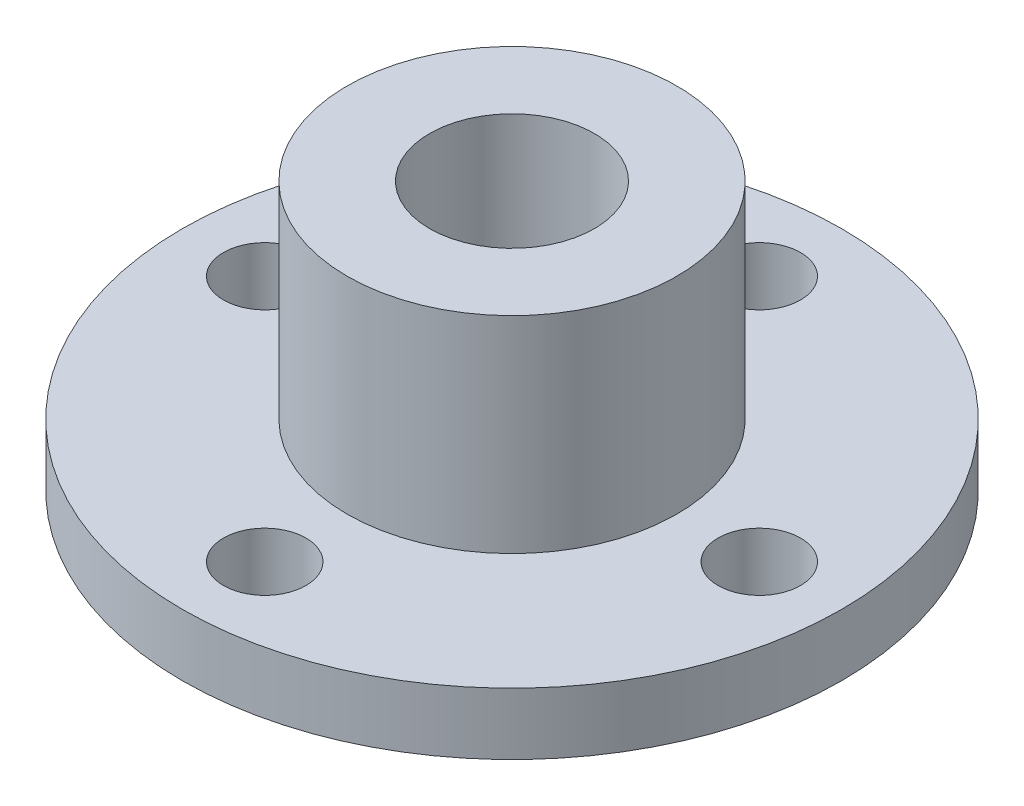
ISO-10303-21;
HEADER;
FILE_DESCRIPTION(('STEP AP214'),'2;1');
FILE_NAME('part.step','',(''),(''),'','','');
FILE_SCHEMA(('AUTOMOTIVE_DESIGN { 1 0 10303 214 1 1 1 1 }'));
ENDSEC;
DATA;
#1=APPLICATION_CONTEXT('core data for automotive mechanical design processes');
#2=APPLICATION_PROTOCOL_DEFINITION('international standard','automotive_design',2000,#1);
#3=PRODUCT_CONTEXT('',#1,'mechanical');
#4=PRODUCT('Part','Part','',(#3));
#5=PRODUCT_RELATED_PRODUCT_CATEGORY('part','',(#4));
#6=PRODUCT_DEFINITION_FORMATION('','',#4);
#7=PRODUCT_DEFINITION_CONTEXT('part definition',#1,'design');
#8=PRODUCT_DEFINITION('design','',#6,#7);
#9=PRODUCT_DEFINITION_SHAPE('','',#8);
#10=(LENGTH_UNIT() NAMED_UNIT(*) SI_UNIT(.MILLI.,.METRE.));
#11=(NAMED_UNIT(*) PLANE_ANGLE_UNIT() SI_UNIT($,.RADIAN.));
#12=(NAMED_UNIT(*) SI_UNIT($,.STERADIAN.) SOLID_ANGLE_UNIT());
#13=UNCERTAINTY_MEASURE_WITH_UNIT(LENGTH_MEASURE(1.E-05),#10,'distance_accuracy_value','');
#14=(GEOMETRIC_REPRESENTATION_CONTEXT(3) GLOBAL_UNCERTAINTY_ASSIGNED_CONTEXT((#13)) GLOBAL_UNIT_ASSIGNED_CONTEXT((#10,
#11,#12)) REPRESENTATION_CONTEXT('',''));
#15=CARTESIAN_POINT('',(0.,0.,0.));
#16=DIRECTION('',(0.,0.,1.));
#17=DIRECTION('',(1.,0.,0.));
#18=AXIS2_PLACEMENT_3D('',#15,#16,#17);
#19=CARTESIAN_POINT('',(0.,3.,-12.));
#20=DIRECTION('',(0.,-1.,0.));
#21=DIRECTION('',(0.,0.,-1.));
#22=AXIS2_PLACEMENT_3D('',#19,#20,#21);
#23=CYLINDRICAL_SURFACE('',#22,2.);
#24=CARTESIAN_POINT('',(0.,3.,-12.));
#25=DIRECTION('',(0.,1.,0.));
#26=DIRECTION('',(0.,0.,1.));
#27=AXIS2_PLACEMENT_3D('',#24,#25,#26);
#28=CIRCLE('',#27,2.);
#29=CARTESIAN_POINT('',(0.,3.,-10.));
#30=VERTEX_POINT('',#29);
#31=EDGE_CURVE('E43',#30,#30,#28,.T.);
#32=ORIENTED_EDGE('',*,*,#31,.T.);
#33=EDGE_LOOP('',(#32));
#34=FACE_BOUND('',#33,.T.);
#35=CARTESIAN_POINT('',(0.,0.,-12.));
#36=DIRECTION('',(0.,1.,0.));
#37=DIRECTION('',(0.,0.,1.));
#38=AXIS2_PLACEMENT_3D('',#35,#36,#37);
#39=CIRCLE('',#38,2.);
#40=CARTESIAN_POINT('',(0.,0.,-10.));
#41=VERTEX_POINT('',#40);
#42=EDGE_CURVE('E50',#41,#41,#39,.T.);
#43=ORIENTED_EDGE('',*,*,#42,.F.);
#44=EDGE_LOOP('',(#43));
#45=FACE_BOUND('',#44,.T.);
#46=ADVANCED_FACE('F31',(#34,#45),#23,.F.);
#47=CARTESIAN_POINT('',(12.,3.,0.));
#48=DIRECTION('',(0.,-1.,0.));
#49=DIRECTION('',(0.,0.,-1.));
#50=AXIS2_PLACEMENT_3D('',#47,#48,#49);
#51=CYLINDRICAL_SURFACE('',#50,2.);
#52=CARTESIAN_POINT('',(12.,3.,0.));
#53=DIRECTION('',(0.,1.,0.));
#54=DIRECTION('',(0.,0.,1.));
#55=AXIS2_PLACEMENT_3D('',#52,#53,#54);
#56=CIRCLE('',#55,2.);
#57=CARTESIAN_POINT('',(12.,3.,2.));
#58=VERTEX_POINT('',#57);
#59=EDGE_CURVE('E62',#58,#58,#56,.T.);
#60=ORIENTED_EDGE('',*,*,#59,.T.);
#61=EDGE_LOOP('',(#60));
#62=FACE_BOUND('',#61,.T.);
#63=CARTESIAN_POINT('',(12.,0.,0.));
#64=DIRECTION('',(0.,1.,0.));
#65=DIRECTION('',(0.,0.,1.));
#66=AXIS2_PLACEMENT_3D('',#63,#64,#65);
#67=CIRCLE('',#66,2.);
#68=CARTESIAN_POINT('',(12.,0.,2.));
#69=VERTEX_POINT('',#68);
#70=EDGE_CURVE('E53',#69,#69,#67,.T.);
#71=ORIENTED_EDGE('',*,*,#70,.F.);
#72=EDGE_LOOP('',(#71));
#73=FACE_BOUND('',#72,.T.);
#74=ADVANCED_FACE('F98',(#62,#73),#51,.F.);
#75=CARTESIAN_POINT('',(0.,3.,0.));
#76=DIRECTION('',(0.,-1.,0.));
#77=DIRECTION('',(0.,0.,-1.));
#78=AXIS2_PLACEMENT_3D('',#75,#76,#77);
#79=CYLINDRICAL_SURFACE('',#78,16.);
#80=CARTESIAN_POINT('',(0.,3.,0.));
#81=DIRECTION('',(0.,1.,0.));
#82=DIRECTION('',(0.,0.,1.));
#83=AXIS2_PLACEMENT_3D('',#80,#81,#82);
#84=CIRCLE('',#83,16.);
#85=CARTESIAN_POINT('',(0.,3.,16.));
#86=VERTEX_POINT('',#85);
#87=EDGE_CURVE('E49',#86,#86,#84,.T.);
#88=ORIENTED_EDGE('',*,*,#87,.F.);
#89=EDGE_LOOP('',(#88));
#90=FACE_BOUND('',#89,.T.);
#91=CARTESIAN_POINT('',(0.,0.,0.));
#92=DIRECTION('',(0.,1.,0.));
#93=DIRECTION('',(0.,0.,1.));
#94=AXIS2_PLACEMENT_3D('',#91,#92,#93);
#95=CIRCLE('',#94,16.);
#96=CARTESIAN_POINT('',(0.,0.,16.));
#97=VERTEX_POINT('',#96);
#98=EDGE_CURVE('E56',#97,#97,#95,.T.);
#99=ORIENTED_EDGE('',*,*,#98,.T.);
#100=EDGE_LOOP('',(#99));
#101=FACE_BOUND('',#100,.T.);
#102=ADVANCED_FACE('F33',(#90,#101),#79,.T.);
#103=CARTESIAN_POINT('',(-12.,3.,0.));
#104=DIRECTION('',(0.,-1.,0.));
#105=DIRECTION('',(0.,0.,-1.));
#106=AXIS2_PLACEMENT_3D('',#103,#104,#105);
#107=CYLINDRICAL_SURFACE('',#106,2.);
#108=CARTESIAN_POINT('',(-12.,3.,0.));
#109=DIRECTION('',(0.,1.,0.));
#110=DIRECTION('',(0.,0.,1.));
#111=AXIS2_PLACEMENT_3D('',#108,#109,#110);
#112=CIRCLE('',#111,2.);
#113=CARTESIAN_POINT('',(-12.,3.,2.));
#114=VERTEX_POINT('',#113);
#115=EDGE_CURVE('E39',#114,#114,#112,.T.);
#116=ORIENTED_EDGE('',*,*,#115,.T.);
#117=EDGE_LOOP('',(#116));
#118=FACE_BOUND('',#117,.T.);
#119=CARTESIAN_POINT('',(-12.,0.,0.));
#120=DIRECTION('',(0.,1.,0.));
#121=DIRECTION('',(0.,0.,1.));
#122=AXIS2_PLACEMENT_3D('',#119,#120,#121);
#123=CIRCLE('',#122,2.);
#124=CARTESIAN_POINT('',(-12.,0.,2.));
#125=VERTEX_POINT('',#124);
#126=EDGE_CURVE('E46',#125,#125,#123,.T.);
#127=ORIENTED_EDGE('',*,*,#126,.F.);
#128=EDGE_LOOP('',(#127));
#129=FACE_BOUND('',#128,.T.);
#130=ADVANCED_FACE('F107',(#118,#129),#107,.F.);
#131=CARTESIAN_POINT('',(0.,3.,0.));
#132=DIRECTION('',(0.,1.,0.));
#133=DIRECTION('',(0.,0.,1.));
#134=AXIS2_PLACEMENT_3D('',#131,#132,#133);
#135=PLANE('',#134);
#136=CARTESIAN_POINT('',(0.,3.,12.));
#137=DIRECTION('',(0.,1.,0.));
#138=DIRECTION('',(0.,0.,1.));
#139=AXIS2_PLACEMENT_3D('',#136,#137,#138);
#140=CIRCLE('',#139,2.);
#141=CARTESIAN_POINT('',(0.,3.,14.));
#142=VERTEX_POINT('',#141);
#143=EDGE_CURVE('E75',#142,#142,#140,.T.);
#144=ORIENTED_EDGE('',*,*,#143,.F.);
#145=EDGE_LOOP('',(#144));
#146=FACE_BOUND('',#145,.T.);
#147=CARTESIAN_POINT('',(0.,3.,0.));
#148=DIRECTION('',(0.,1.,0.));
#149=DIRECTION('',(0.,0.,1.));
#150=AXIS2_PLACEMENT_3D('',#147,#148,#149);
#151=CIRCLE('',#150,8.);
#152=CARTESIAN_POINT('',(0.,3.,8.));
#153=VERTEX_POINT('',#152);
#154=EDGE_CURVE('E67',#153,#153,#151,.T.);
#155=ORIENTED_EDGE('',*,*,#154,.F.);
#156=EDGE_LOOP('',(#155));
#157=FACE_BOUND('',#156,.T.);
#158=ORIENTED_EDGE('',*,*,#87,.T.);
#159=EDGE_LOOP('',(#158));
#160=FACE_BOUND('',#159,.T.);
#161=ORIENTED_EDGE('',*,*,#59,.F.);
#162=EDGE_LOOP('',(#161));
#163=FACE_BOUND('',#162,.T.);
#164=ORIENTED_EDGE('',*,*,#31,.F.);
#165=EDGE_LOOP('',(#164));
#166=FACE_BOUND('',#165,.T.);
#167=ORIENTED_EDGE('',*,*,#115,.F.);
#168=EDGE_LOOP('',(#167));
#169=FACE_BOUND('',#168,.T.);
#170=ADVANCED_FACE('F95',(#146,#157,#160,#163,#166,#169),#135,.T.);
#171=CARTESIAN_POINT('',(0.,0.,0.));
#172=DIRECTION('',(0.,1.,0.));
#173=DIRECTION('',(0.,0.,1.));
#174=AXIS2_PLACEMENT_3D('',#171,#172,#173);
#175=PLANE('',#174);
#176=CARTESIAN_POINT('',(0.,0.,12.));
#177=DIRECTION('',(0.,1.,0.));
#178=DIRECTION('',(0.,0.,1.));
#179=AXIS2_PLACEMENT_3D('',#176,#177,#178);
#180=CIRCLE('',#179,2.);
#181=CARTESIAN_POINT('',(0.,0.,14.));
#182=VERTEX_POINT('',#181);
#183=EDGE_CURVE('E35',#182,#182,#180,.T.);
#184=ORIENTED_EDGE('',*,*,#183,.T.);
#185=EDGE_LOOP('',(#184));
#186=FACE_BOUND('',#185,.T.);
#187=ORIENTED_EDGE('',*,*,#98,.F.);
#188=EDGE_LOOP('',(#187));
#189=FACE_BOUND('',#188,.T.);
#190=ORIENTED_EDGE('',*,*,#70,.T.);
#191=EDGE_LOOP('',(#190));
#192=FACE_BOUND('',#191,.T.);
#193=ORIENTED_EDGE('',*,*,#42,.T.);
#194=EDGE_LOOP('',(#193));
#195=FACE_BOUND('',#194,.T.);
#196=ORIENTED_EDGE('',*,*,#126,.T.);
#197=EDGE_LOOP('',(#196));
#198=FACE_BOUND('',#197,.T.);
#199=ADVANCED_FACE('F82',(#186,#189,#192,#195,#198),#175,.F.);
#200=CARTESIAN_POINT('',(0.,13.,0.));
#201=DIRECTION('',(0.,1.,0.));
#202=DIRECTION('',(0.,0.,1.));
#203=AXIS2_PLACEMENT_3D('',#200,#201,#202);
#204=PLANE('',#203);
#205=CARTESIAN_POINT('',(0.,13.,0.));
#206=DIRECTION('',(0.,1.,0.));
#207=DIRECTION('',(0.,0.,1.));
#208=AXIS2_PLACEMENT_3D('',#205,#206,#207);
#209=CIRCLE('',#208,8.);
#210=CARTESIAN_POINT('',(0.,13.,8.));
#211=VERTEX_POINT('',#210);
#212=EDGE_CURVE('E58',#211,#211,#209,.T.);
#213=ORIENTED_EDGE('',*,*,#212,.T.);
#214=EDGE_LOOP('',(#213));
#215=FACE_BOUND('',#214,.T.);
#216=CARTESIAN_POINT('',(0.,13.,0.));
#217=DIRECTION('',(0.,1.,0.));
#218=DIRECTION('',(0.,0.,1.));
#219=AXIS2_PLACEMENT_3D('',#216,#217,#218);
#220=CIRCLE('',#219,4.);
#221=CARTESIAN_POINT('',(0.,13.,4.));
#222=VERTEX_POINT('',#221);
#223=EDGE_CURVE('E70',#222,#222,#220,.T.);
#224=ORIENTED_EDGE('',*,*,#223,.F.);
#225=EDGE_LOOP('',(#224));
#226=FACE_BOUND('',#225,.T.);
#227=ADVANCED_FACE('F112',(#215,#226),#204,.T.);
#228=CARTESIAN_POINT('',(0.,13.,0.));
#229=DIRECTION('',(0.,-1.,0.));
#230=DIRECTION('',(0.,0.,-1.));
#231=AXIS2_PLACEMENT_3D('',#228,#229,#230);
#232=CYLINDRICAL_SURFACE('',#231,8.);
#233=ORIENTED_EDGE('',*,*,#212,.F.);
#234=EDGE_LOOP('',(#233));
#235=FACE_BOUND('',#234,.T.);
#236=ORIENTED_EDGE('',*,*,#154,.T.);
#237=EDGE_LOOP('',(#236));
#238=FACE_BOUND('',#237,.T.);
#239=ADVANCED_FACE('F116',(#235,#238),#232,.T.);
#240=CARTESIAN_POINT('',(0.,13.,0.));
#241=DIRECTION('',(0.,-1.,0.));
#242=DIRECTION('',(0.,0.,-1.));
#243=AXIS2_PLACEMENT_3D('',#240,#241,#242);
#244=CYLINDRICAL_SURFACE('',#243,4.);
#245=ORIENTED_EDGE('',*,*,#223,.T.);
#246=EDGE_LOOP('',(#245));
#247=FACE_BOUND('',#246,.T.);
#248=CARTESIAN_POINT('',(0.,3.,0.));
#249=DIRECTION('',(0.,1.,0.));
#250=DIRECTION('',(0.,0.,1.));
#251=AXIS2_PLACEMENT_3D('',#248,#249,#250);
#252=CIRCLE('',#251,4.);
#253=CARTESIAN_POINT('',(0.,3.,4.));
#254=VERTEX_POINT('',#253);
#255=EDGE_CURVE('E10',#254,#254,#252,.F.);
#256=ORIENTED_EDGE('',*,*,#255,.T.);
#257=EDGE_LOOP('',(#256));
#258=FACE_BOUND('',#257,.T.);
#259=ADVANCED_FACE('F92',(#247,#258),#244,.F.);
#260=ORIENTED_EDGE('',*,*,#255,.F.);
#261=EDGE_LOOP('',(#260));
#262=FACE_BOUND('',#261,.T.);
#263=ADVANCED_FACE('F87',(#262),#135,.T.);
#264=CARTESIAN_POINT('',(0.,-56.,12.));
#265=DIRECTION('',(0.,1.,0.));
#266=DIRECTION('',(0.,0.,1.));
#267=AXIS2_PLACEMENT_3D('',#264,#265,#266);
#268=CYLINDRICAL_SURFACE('',#267,2.);
#269=ORIENTED_EDGE('',*,*,#143,.T.);
#270=EDGE_LOOP('',(#269));
#271=FACE_BOUND('',#270,.T.);
#272=ORIENTED_EDGE('',*,*,#183,.F.);
#273=EDGE_LOOP('',(#272));
#274=FACE_BOUND('',#273,.T.);
#275=ADVANCED_FACE('F85',(#271,#274),#268,.F.);
#276=CLOSED_SHELL('',(#46,#74,#102,#130,#170,#199,#227,#239,#259,#263,#275));
#277=MANIFOLD_SOLID_BREP('B2',#276);
#278=ADVANCED_BREP_SHAPE_REPRESENTATION('',(#18,#277),#14);
#279=SHAPE_DEFINITION_REPRESENTATION(#9,#278);
ENDSEC;
END-ISO-10303-21;
